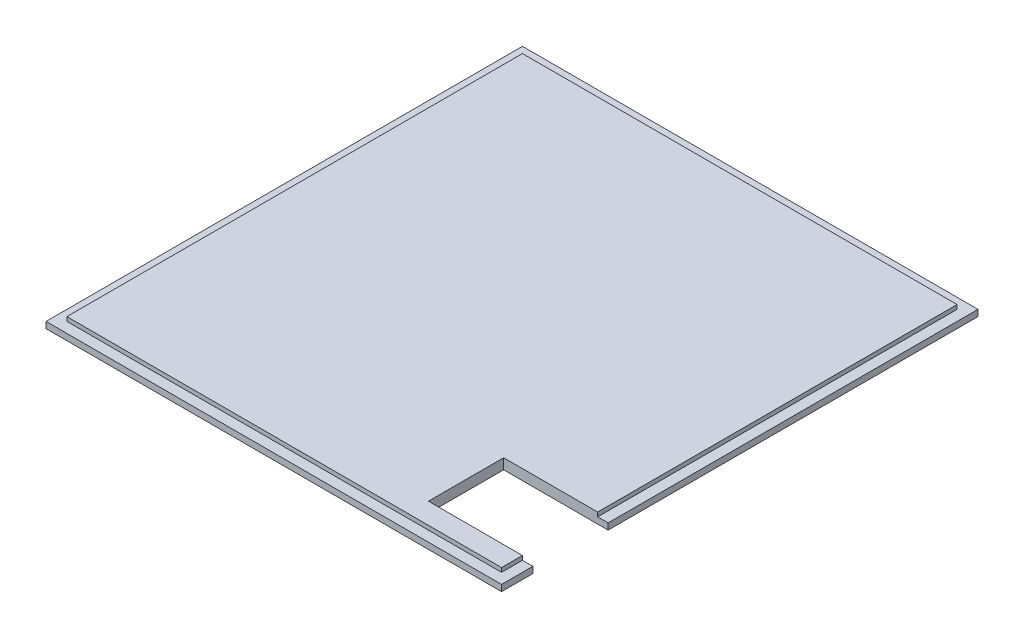
ISO-10303-21;
HEADER;
FILE_DESCRIPTION(('STEP AP214'),'2;1');
FILE_NAME('part.step','',(''),(''),'','','');
FILE_SCHEMA(('AUTOMOTIVE_DESIGN { 1 0 10303 214 1 1 1 1 }'));
ENDSEC;
DATA;
#1=APPLICATION_CONTEXT('core data for automotive mechanical design processes');
#2=APPLICATION_PROTOCOL_DEFINITION('international standard','automotive_design',2000,#1);
#3=PRODUCT_CONTEXT('',#1,'mechanical');
#4=PRODUCT('Part','Part','',(#3));
#5=PRODUCT_RELATED_PRODUCT_CATEGORY('part','',(#4));
#6=PRODUCT_DEFINITION_FORMATION('','',#4);
#7=PRODUCT_DEFINITION_CONTEXT('part definition',#1,'design');
#8=PRODUCT_DEFINITION('design','',#6,#7);
#9=PRODUCT_DEFINITION_SHAPE('','',#8);
#10=(LENGTH_UNIT() NAMED_UNIT(*) SI_UNIT(.MILLI.,.METRE.));
#11=(NAMED_UNIT(*) PLANE_ANGLE_UNIT() SI_UNIT($,.RADIAN.));
#12=(NAMED_UNIT(*) SI_UNIT($,.STERADIAN.) SOLID_ANGLE_UNIT());
#13=UNCERTAINTY_MEASURE_WITH_UNIT(LENGTH_MEASURE(1.E-05),#10,'distance_accuracy_value','');
#14=(GEOMETRIC_REPRESENTATION_CONTEXT(3) GLOBAL_UNCERTAINTY_ASSIGNED_CONTEXT((#13)) GLOBAL_UNIT_ASSIGNED_CONTEXT((#10,
#11,#12)) REPRESENTATION_CONTEXT('',''));
#15=CARTESIAN_POINT('',(0.,0.,0.));
#16=DIRECTION('',(0.,0.,1.));
#17=DIRECTION('',(1.,0.,0.));
#18=AXIS2_PLACEMENT_3D('',#15,#16,#17);
#19=CARTESIAN_POINT('',(54.5,1.5,57.));
#20=DIRECTION('',(-1.,0.,0.));
#21=DIRECTION('',(0.,0.,1.));
#22=AXIS2_PLACEMENT_3D('',#19,#20,#21);
#23=PLANE('',#22);
#24=DIRECTION('',(0.,0.,-1.));
#25=VECTOR('',#24,1.);
#26=CARTESIAN_POINT('',(54.5,0.,57.));
#27=LINE('',#26,#25);
#28=CARTESIAN_POINT('',(54.5,0.,57.));
#29=VERTEX_POINT('',#28);
#30=CARTESIAN_POINT('',(54.5,0.,49.5));
#31=VERTEX_POINT('',#30);
#32=EDGE_CURVE('E261',#29,#31,#27,.T.);
#33=ORIENTED_EDGE('',*,*,#32,.T.);
#34=DIRECTION('',(0.,1.,0.));
#35=VECTOR('',#34,1.);
#36=CARTESIAN_POINT('',(54.5,-30.8058436014987,49.5));
#37=LINE('',#36,#35);
#38=CARTESIAN_POINT('',(54.5,1.5,49.5));
#39=VERTEX_POINT('',#38);
#40=EDGE_CURVE('E169',#31,#39,#37,.T.);
#41=ORIENTED_EDGE('',*,*,#40,.T.);
#42=DIRECTION('',(0.,0.,-1.));
#43=VECTOR('',#42,1.);
#44=CARTESIAN_POINT('',(54.5,1.5,57.));
#45=LINE('',#44,#43);
#46=CARTESIAN_POINT('',(54.5,1.5,57.));
#47=VERTEX_POINT('',#46);
#48=EDGE_CURVE('E246',#47,#39,#45,.T.);
#49=ORIENTED_EDGE('',*,*,#48,.F.);
#50=DIRECTION('',(0.,-1.,0.));
#51=VECTOR('',#50,1.);
#52=CARTESIAN_POINT('',(54.5,1.5,57.));
#53=LINE('',#52,#51);
#54=EDGE_CURVE('E274',#47,#29,#53,.T.);
#55=ORIENTED_EDGE('',*,*,#54,.T.);
#56=EDGE_LOOP('',(#33,#41,#49,#55));
#57=FACE_BOUND('',#56,.T.);
#58=ADVANCED_FACE('F39',(#57),#23,.F.);
#59=CARTESIAN_POINT('',(52.,2.5,54.5));
#60=DIRECTION('',(-1.,0.,0.));
#61=DIRECTION('',(0.,0.,1.));
#62=AXIS2_PLACEMENT_3D('',#59,#60,#61);
#63=PLANE('',#62);
#64=DIRECTION('',(0.,0.,-1.));
#65=VECTOR('',#64,1.);
#66=CARTESIAN_POINT('',(52.,1.5,54.5));
#67=LINE('',#66,#65);
#68=CARTESIAN_POINT('',(52.,1.5,54.5));
#69=VERTEX_POINT('',#68);
#70=CARTESIAN_POINT('',(52.,1.5,49.5));
#71=VERTEX_POINT('',#70);
#72=EDGE_CURVE('E215',#69,#71,#67,.T.);
#73=ORIENTED_EDGE('',*,*,#72,.T.);
#74=DIRECTION('',(0.,1.,0.));
#75=VECTOR('',#74,1.);
#76=CARTESIAN_POINT('',(52.,2.5,49.5));
#77=LINE('',#76,#75);
#78=CARTESIAN_POINT('',(52.,2.5,49.5));
#79=VERTEX_POINT('',#78);
#80=EDGE_CURVE('E185',#71,#79,#77,.T.);
#81=ORIENTED_EDGE('',*,*,#80,.T.);
#82=DIRECTION('',(0.,0.,-1.));
#83=VECTOR('',#82,1.);
#84=CARTESIAN_POINT('',(52.,2.5,54.5));
#85=LINE('',#84,#83);
#86=CARTESIAN_POINT('',(52.,2.5,54.5));
#87=VERTEX_POINT('',#86);
#88=EDGE_CURVE('E201',#87,#79,#85,.T.);
#89=ORIENTED_EDGE('',*,*,#88,.F.);
#90=DIRECTION('',(0.,-1.,0.));
#91=VECTOR('',#90,1.);
#92=CARTESIAN_POINT('',(52.,2.5,54.5));
#93=LINE('',#92,#91);
#94=EDGE_CURVE('E228',#87,#69,#93,.T.);
#95=ORIENTED_EDGE('',*,*,#94,.T.);
#96=EDGE_LOOP('',(#73,#81,#89,#95));
#97=FACE_BOUND('',#96,.T.);
#98=ADVANCED_FACE('F330',(#97),#63,.F.);
#99=CARTESIAN_POINT('',(-54.5,1.5,57.));
#100=DIRECTION('',(1.,0.,0.));
#101=DIRECTION('',(0.,0.,-1.));
#102=AXIS2_PLACEMENT_3D('',#99,#100,#101);
#103=PLANE('',#102);
#104=DIRECTION('',(0.,0.,1.));
#105=VECTOR('',#104,1.);
#106=CARTESIAN_POINT('',(-54.5,0.,57.));
#107=LINE('',#106,#105);
#108=CARTESIAN_POINT('',(-54.5,0.,-57.));
#109=VERTEX_POINT('',#108);
#110=CARTESIAN_POINT('',(-54.5,0.,57.));
#111=VERTEX_POINT('',#110);
#112=EDGE_CURVE('E236',#109,#111,#107,.T.);
#113=ORIENTED_EDGE('',*,*,#112,.T.);
#114=DIRECTION('',(0.,-1.,0.));
#115=VECTOR('',#114,1.);
#116=CARTESIAN_POINT('',(-54.5,1.5,57.));
#117=LINE('',#116,#115);
#118=CARTESIAN_POINT('',(-54.5,1.5,57.));
#119=VERTEX_POINT('',#118);
#120=EDGE_CURVE('E48',#119,#111,#117,.T.);
#121=ORIENTED_EDGE('',*,*,#120,.F.);
#122=DIRECTION('',(0.,0.,1.));
#123=VECTOR('',#122,1.);
#124=CARTESIAN_POINT('',(-54.5,1.5,57.));
#125=LINE('',#124,#123);
#126=CARTESIAN_POINT('',(-54.5,1.5,-57.));
#127=VERTEX_POINT('',#126);
#128=EDGE_CURVE('E237',#127,#119,#125,.T.);
#129=ORIENTED_EDGE('',*,*,#128,.F.);
#130=DIRECTION('',(0.,-1.,0.));
#131=VECTOR('',#130,1.);
#132=CARTESIAN_POINT('',(-54.5,1.5,-57.));
#133=LINE('',#132,#131);
#134=EDGE_CURVE('E253',#127,#109,#133,.T.);
#135=ORIENTED_EDGE('',*,*,#134,.T.);
#136=EDGE_LOOP('',(#113,#121,#129,#135));
#137=FACE_BOUND('',#136,.T.);
#138=ADVANCED_FACE('F41',(#137),#103,.F.);
#139=CARTESIAN_POINT('',(54.5,1.5,57.));
#140=DIRECTION('',(0.,0.,-1.));
#141=DIRECTION('',(-1.,0.,0.));
#142=AXIS2_PLACEMENT_3D('',#139,#140,#141);
#143=PLANE('',#142);
#144=DIRECTION('',(1.,0.,0.));
#145=VECTOR('',#144,1.);
#146=CARTESIAN_POINT('',(54.5,0.,57.));
#147=LINE('',#146,#145);
#148=EDGE_CURVE('E257',#111,#29,#147,.T.);
#149=ORIENTED_EDGE('',*,*,#148,.T.);
#150=ORIENTED_EDGE('',*,*,#54,.F.);
#151=DIRECTION('',(1.,0.,0.));
#152=VECTOR('',#151,1.);
#153=CARTESIAN_POINT('',(54.5,1.5,57.));
#154=LINE('',#153,#152);
#155=EDGE_CURVE('E241',#119,#47,#154,.T.);
#156=ORIENTED_EDGE('',*,*,#155,.F.);
#157=ORIENTED_EDGE('',*,*,#120,.T.);
#158=EDGE_LOOP('',(#149,#150,#156,#157));
#159=FACE_BOUND('',#158,.T.);
#160=ADVANCED_FACE('F281',(#159),#143,.F.);
#161=CARTESIAN_POINT('',(54.5,1.5,31.5));
#162=VERTEX_POINT('',#161);
#163=CARTESIAN_POINT('',(54.5,1.5,-57.));
#164=VERTEX_POINT('',#163);
#165=EDGE_CURVE('E245',#162,#164,#45,.T.);
#166=ORIENTED_EDGE('',*,*,#165,.F.);
#167=DIRECTION('',(0.,1.,0.));
#168=VECTOR('',#167,1.);
#169=CARTESIAN_POINT('',(54.5,-30.8058436014987,31.5));
#170=LINE('',#169,#168);
#171=CARTESIAN_POINT('',(54.5,0.,31.5));
#172=VERTEX_POINT('',#171);
#173=EDGE_CURVE('E156',#172,#162,#170,.T.);
#174=ORIENTED_EDGE('',*,*,#173,.F.);
#175=CARTESIAN_POINT('',(54.5,0.,-57.));
#176=VERTEX_POINT('',#175);
#177=EDGE_CURVE('E260',#172,#176,#27,.T.);
#178=ORIENTED_EDGE('',*,*,#177,.T.);
#179=DIRECTION('',(0.,-1.,0.));
#180=VECTOR('',#179,1.);
#181=CARTESIAN_POINT('',(54.5,1.5,-57.));
#182=LINE('',#181,#180);
#183=EDGE_CURVE('E270',#164,#176,#182,.T.);
#184=ORIENTED_EDGE('',*,*,#183,.F.);
#185=EDGE_LOOP('',(#166,#174,#178,#184));
#186=FACE_BOUND('',#185,.T.);
#187=ADVANCED_FACE('F304',(#186),#23,.F.);
#188=CARTESIAN_POINT('',(54.5,1.5,-57.));
#189=DIRECTION('',(0.,0.,1.));
#190=DIRECTION('',(1.,0.,0.));
#191=AXIS2_PLACEMENT_3D('',#188,#189,#190);
#192=PLANE('',#191);
#193=DIRECTION('',(-1.,0.,0.));
#194=VECTOR('',#193,1.);
#195=CARTESIAN_POINT('',(54.5,0.,-57.));
#196=LINE('',#195,#194);
#197=EDGE_CURVE('E242',#176,#109,#196,.T.);
#198=ORIENTED_EDGE('',*,*,#197,.T.);
#199=ORIENTED_EDGE('',*,*,#134,.F.);
#200=DIRECTION('',(-1.,0.,0.));
#201=VECTOR('',#200,1.);
#202=CARTESIAN_POINT('',(54.5,1.5,-57.));
#203=LINE('',#202,#201);
#204=EDGE_CURVE('E250',#164,#127,#203,.T.);
#205=ORIENTED_EDGE('',*,*,#204,.F.);
#206=ORIENTED_EDGE('',*,*,#183,.T.);
#207=EDGE_LOOP('',(#198,#199,#205,#206));
#208=FACE_BOUND('',#207,.T.);
#209=ADVANCED_FACE('F302',(#208),#192,.F.);
#210=CARTESIAN_POINT('',(0.,1.5,0.));
#211=DIRECTION('',(0.,1.,0.));
#212=DIRECTION('',(0.,0.,1.));
#213=AXIS2_PLACEMENT_3D('',#210,#211,#212);
#214=PLANE('',#213);
#215=DIRECTION('',(1.,0.,0.));
#216=VECTOR('',#215,1.);
#217=CARTESIAN_POINT('',(0.,1.5,49.5));
#218=LINE('',#217,#216);
#219=EDGE_CURVE('E189',#71,#39,#218,.T.);
#220=ORIENTED_EDGE('',*,*,#219,.F.);
#221=ORIENTED_EDGE('',*,*,#72,.F.);
#222=DIRECTION('',(1.,0.,0.));
#223=VECTOR('',#222,1.);
#224=CARTESIAN_POINT('',(52.,1.5,54.5));
#225=LINE('',#224,#223);
#226=CARTESIAN_POINT('',(-52.,1.5,54.5));
#227=VERTEX_POINT('',#226);
#228=EDGE_CURVE('E210',#227,#69,#225,.T.);
#229=ORIENTED_EDGE('',*,*,#228,.F.);
#230=DIRECTION('',(0.,0.,1.));
#231=VECTOR('',#230,1.);
#232=CARTESIAN_POINT('',(-52.,1.5,54.5));
#233=LINE('',#232,#231);
#234=CARTESIAN_POINT('',(-52.,1.5,-54.5));
#235=VERTEX_POINT('',#234);
#236=EDGE_CURVE('E62',#235,#227,#233,.T.);
#237=ORIENTED_EDGE('',*,*,#236,.F.);
#238=DIRECTION('',(-1.,0.,0.));
#239=VECTOR('',#238,1.);
#240=CARTESIAN_POINT('',(52.,1.5,-54.5));
#241=LINE('',#240,#239);
#242=CARTESIAN_POINT('',(52.,1.5,-54.5));
#243=VERTEX_POINT('',#242);
#244=EDGE_CURVE('E197',#243,#235,#241,.T.);
#245=ORIENTED_EDGE('',*,*,#244,.F.);
#246=CARTESIAN_POINT('',(52.,1.5,31.5));
#247=VERTEX_POINT('',#246);
#248=EDGE_CURVE('E214',#247,#243,#67,.T.);
#249=ORIENTED_EDGE('',*,*,#248,.F.);
#250=DIRECTION('',(-1.,0.,0.));
#251=VECTOR('',#250,1.);
#252=CARTESIAN_POINT('',(0.,1.5,31.5));
#253=LINE('',#252,#251);
#254=EDGE_CURVE('E182',#162,#247,#253,.T.);
#255=ORIENTED_EDGE('',*,*,#254,.F.);
#256=ORIENTED_EDGE('',*,*,#165,.T.);
#257=ORIENTED_EDGE('',*,*,#204,.T.);
#258=ORIENTED_EDGE('',*,*,#128,.T.);
#259=ORIENTED_EDGE('',*,*,#155,.T.);
#260=ORIENTED_EDGE('',*,*,#48,.T.);
#261=EDGE_LOOP('',(#220,#221,#229,#237,#245,#249,#255,#256,#257,#258,#259,#260));
#262=FACE_BOUND('',#261,.T.);
#263=ADVANCED_FACE('F296',(#262),#214,.T.);
#264=CARTESIAN_POINT('',(0.,0.,0.));
#265=DIRECTION('',(0.,1.,0.));
#266=DIRECTION('',(0.,0.,1.));
#267=AXIS2_PLACEMENT_3D('',#264,#265,#266);
#268=PLANE('',#267);
#269=DIRECTION('',(0.,0.,-1.));
#270=VECTOR('',#269,1.);
#271=CARTESIAN_POINT('',(29.5,0.,49.5));
#272=LINE('',#271,#270);
#273=CARTESIAN_POINT('',(29.5,0.,49.5));
#274=VERTEX_POINT('',#273);
#275=CARTESIAN_POINT('',(29.5,0.,31.5));
#276=VERTEX_POINT('',#275);
#277=EDGE_CURVE('E153',#274,#276,#272,.T.);
#278=ORIENTED_EDGE('',*,*,#277,.F.);
#279=DIRECTION('',(-1.,0.,0.));
#280=VECTOR('',#279,1.);
#281=CARTESIAN_POINT('',(54.5,0.,49.5));
#282=LINE('',#281,#280);
#283=EDGE_CURVE('E166',#31,#274,#282,.T.);
#284=ORIENTED_EDGE('',*,*,#283,.F.);
#285=ORIENTED_EDGE('',*,*,#32,.F.);
#286=ORIENTED_EDGE('',*,*,#148,.F.);
#287=ORIENTED_EDGE('',*,*,#112,.F.);
#288=ORIENTED_EDGE('',*,*,#197,.F.);
#289=ORIENTED_EDGE('',*,*,#177,.F.);
#290=DIRECTION('',(1.,0.,0.));
#291=VECTOR('',#290,1.);
#292=CARTESIAN_POINT('',(54.5,0.,31.5));
#293=LINE('',#292,#291);
#294=EDGE_CURVE('E177',#276,#172,#293,.T.);
#295=ORIENTED_EDGE('',*,*,#294,.F.);
#296=EDGE_LOOP('',(#278,#284,#285,#286,#287,#288,#289,#295));
#297=FACE_BOUND('',#296,.T.);
#298=ADVANCED_FACE('F289',(#297),#268,.F.);
#299=CARTESIAN_POINT('',(-52.,2.5,54.5));
#300=DIRECTION('',(1.,0.,0.));
#301=DIRECTION('',(0.,0.,-1.));
#302=AXIS2_PLACEMENT_3D('',#299,#300,#301);
#303=PLANE('',#302);
#304=ORIENTED_EDGE('',*,*,#236,.T.);
#305=DIRECTION('',(0.,-1.,0.));
#306=VECTOR('',#305,1.);
#307=CARTESIAN_POINT('',(-52.,2.5,54.5));
#308=LINE('',#307,#306);
#309=CARTESIAN_POINT('',(-52.,2.5,54.5));
#310=VERTEX_POINT('',#309);
#311=EDGE_CURVE('E232',#310,#227,#308,.T.);
#312=ORIENTED_EDGE('',*,*,#311,.F.);
#313=DIRECTION('',(0.,0.,1.));
#314=VECTOR('',#313,1.);
#315=CARTESIAN_POINT('',(-52.,2.5,54.5));
#316=LINE('',#315,#314);
#317=CARTESIAN_POINT('',(-52.,2.5,-54.5));
#318=VERTEX_POINT('',#317);
#319=EDGE_CURVE('E192',#318,#310,#316,.T.);
#320=ORIENTED_EDGE('',*,*,#319,.F.);
#321=DIRECTION('',(0.,-1.,0.));
#322=VECTOR('',#321,1.);
#323=CARTESIAN_POINT('',(-52.,2.5,-54.5));
#324=LINE('',#323,#322);
#325=EDGE_CURVE('E207',#318,#235,#324,.T.);
#326=ORIENTED_EDGE('',*,*,#325,.T.);
#327=EDGE_LOOP('',(#304,#312,#320,#326));
#328=FACE_BOUND('',#327,.T.);
#329=ADVANCED_FACE('F324',(#328),#303,.F.);
#330=CARTESIAN_POINT('',(52.,2.5,54.5));
#331=DIRECTION('',(0.,0.,-1.));
#332=DIRECTION('',(-1.,0.,0.));
#333=AXIS2_PLACEMENT_3D('',#330,#331,#332);
#334=PLANE('',#333);
#335=ORIENTED_EDGE('',*,*,#228,.T.);
#336=ORIENTED_EDGE('',*,*,#94,.F.);
#337=DIRECTION('',(1.,0.,0.));
#338=VECTOR('',#337,1.);
#339=CARTESIAN_POINT('',(52.,2.5,54.5));
#340=LINE('',#339,#338);
#341=EDGE_CURVE('E196',#310,#87,#340,.T.);
#342=ORIENTED_EDGE('',*,*,#341,.F.);
#343=ORIENTED_EDGE('',*,*,#311,.T.);
#344=EDGE_LOOP('',(#335,#336,#342,#343));
#345=FACE_BOUND('',#344,.T.);
#346=ADVANCED_FACE('F326',(#345),#334,.F.);
#347=CARTESIAN_POINT('',(52.,2.5,31.5));
#348=VERTEX_POINT('',#347);
#349=CARTESIAN_POINT('',(52.,2.5,-54.5));
#350=VERTEX_POINT('',#349);
#351=EDGE_CURVE('E200',#348,#350,#85,.T.);
#352=ORIENTED_EDGE('',*,*,#351,.F.);
#353=DIRECTION('',(0.,-1.,0.));
#354=VECTOR('',#353,1.);
#355=CARTESIAN_POINT('',(52.,2.5,31.5));
#356=LINE('',#355,#354);
#357=EDGE_CURVE('E54',#348,#247,#356,.T.);
#358=ORIENTED_EDGE('',*,*,#357,.T.);
#359=ORIENTED_EDGE('',*,*,#248,.T.);
#360=DIRECTION('',(0.,-1.,0.));
#361=VECTOR('',#360,1.);
#362=CARTESIAN_POINT('',(52.,2.5,-54.5));
#363=LINE('',#362,#361);
#364=EDGE_CURVE('E224',#350,#243,#363,.T.);
#365=ORIENTED_EDGE('',*,*,#364,.F.);
#366=EDGE_LOOP('',(#352,#358,#359,#365));
#367=FACE_BOUND('',#366,.T.);
#368=ADVANCED_FACE('F316',(#367),#63,.F.);
#369=CARTESIAN_POINT('',(52.,2.5,-54.5));
#370=DIRECTION('',(0.,0.,1.));
#371=DIRECTION('',(1.,0.,0.));
#372=AXIS2_PLACEMENT_3D('',#369,#370,#371);
#373=PLANE('',#372);
#374=ORIENTED_EDGE('',*,*,#244,.T.);
#375=ORIENTED_EDGE('',*,*,#325,.F.);
#376=DIRECTION('',(-1.,0.,0.));
#377=VECTOR('',#376,1.);
#378=CARTESIAN_POINT('',(52.,2.5,-54.5));
#379=LINE('',#378,#377);
#380=EDGE_CURVE('E204',#350,#318,#379,.T.);
#381=ORIENTED_EDGE('',*,*,#380,.F.);
#382=ORIENTED_EDGE('',*,*,#364,.T.);
#383=EDGE_LOOP('',(#374,#375,#381,#382));
#384=FACE_BOUND('',#383,.T.);
#385=ADVANCED_FACE('F322',(#384),#373,.F.);
#386=CARTESIAN_POINT('',(0.,2.5,0.));
#387=DIRECTION('',(0.,1.,0.));
#388=DIRECTION('',(0.,0.,1.));
#389=AXIS2_PLACEMENT_3D('',#386,#387,#388);
#390=PLANE('',#389);
#391=DIRECTION('',(1.,0.,0.));
#392=VECTOR('',#391,1.);
#393=CARTESIAN_POINT('',(54.5,2.5,49.5));
#394=LINE('',#393,#392);
#395=CARTESIAN_POINT('',(29.5,2.5,49.5));
#396=VERTEX_POINT('',#395);
#397=EDGE_CURVE('E160',#396,#79,#394,.T.);
#398=ORIENTED_EDGE('',*,*,#397,.F.);
#399=DIRECTION('',(0.,0.,1.));
#400=VECTOR('',#399,1.);
#401=CARTESIAN_POINT('',(29.5,2.5,49.5));
#402=LINE('',#401,#400);
#403=CARTESIAN_POINT('',(29.5,2.5,31.5));
#404=VERTEX_POINT('',#403);
#405=EDGE_CURVE('E150',#404,#396,#402,.T.);
#406=ORIENTED_EDGE('',*,*,#405,.F.);
#407=DIRECTION('',(-1.,0.,0.));
#408=VECTOR('',#407,1.);
#409=CARTESIAN_POINT('',(0.,2.5,31.5));
#410=LINE('',#409,#408);
#411=EDGE_CURVE('E11',#348,#404,#410,.T.);
#412=ORIENTED_EDGE('',*,*,#411,.F.);
#413=ORIENTED_EDGE('',*,*,#351,.T.);
#414=ORIENTED_EDGE('',*,*,#380,.T.);
#415=ORIENTED_EDGE('',*,*,#319,.T.);
#416=ORIENTED_EDGE('',*,*,#341,.T.);
#417=ORIENTED_EDGE('',*,*,#88,.T.);
#418=EDGE_LOOP('',(#398,#406,#412,#413,#414,#415,#416,#417));
#419=FACE_BOUND('',#418,.T.);
#420=ADVANCED_FACE('F158',(#419),#390,.T.);
#421=CARTESIAN_POINT('',(54.5,-30.8058436014987,49.5));
#422=DIRECTION('',(0.,0.,1.));
#423=DIRECTION('',(1.,0.,0.));
#424=AXIS2_PLACEMENT_3D('',#421,#422,#423);
#425=PLANE('',#424);
#426=ORIENTED_EDGE('',*,*,#219,.T.);
#427=ORIENTED_EDGE('',*,*,#40,.F.);
#428=ORIENTED_EDGE('',*,*,#283,.T.);
#429=DIRECTION('',(0.,1.,0.));
#430=VECTOR('',#429,1.);
#431=CARTESIAN_POINT('',(29.5,-30.8058436014987,49.5));
#432=LINE('',#431,#430);
#433=EDGE_CURVE('E155',#274,#396,#432,.T.);
#434=ORIENTED_EDGE('',*,*,#433,.T.);
#435=ORIENTED_EDGE('',*,*,#397,.T.);
#436=ORIENTED_EDGE('',*,*,#80,.F.);
#437=EDGE_LOOP('',(#426,#427,#428,#434,#435,#436));
#438=FACE_BOUND('',#437,.T.);
#439=ADVANCED_FACE('F312',(#438),#425,.F.);
#440=CARTESIAN_POINT('',(29.5,-30.8058436014987,49.5));
#441=DIRECTION('',(-1.,0.,0.));
#442=DIRECTION('',(0.,0.,1.));
#443=AXIS2_PLACEMENT_3D('',#440,#441,#442);
#444=PLANE('',#443);
#445=ORIENTED_EDGE('',*,*,#277,.T.);
#446=DIRECTION('',(0.,1.,0.));
#447=VECTOR('',#446,1.);
#448=CARTESIAN_POINT('',(29.5,-30.8058436014987,31.5));
#449=LINE('',#448,#447);
#450=EDGE_CURVE('E141',#276,#404,#449,.T.);
#451=ORIENTED_EDGE('',*,*,#450,.T.);
#452=ORIENTED_EDGE('',*,*,#405,.T.);
#453=ORIENTED_EDGE('',*,*,#433,.F.);
#454=EDGE_LOOP('',(#445,#451,#452,#453));
#455=FACE_BOUND('',#454,.T.);
#456=ADVANCED_FACE('F148',(#455),#444,.F.);
#457=CARTESIAN_POINT('',(54.5,-30.8058436014987,31.5));
#458=DIRECTION('',(0.,0.,-1.));
#459=DIRECTION('',(-1.,0.,0.));
#460=AXIS2_PLACEMENT_3D('',#457,#458,#459);
#461=PLANE('',#460);
#462=ORIENTED_EDGE('',*,*,#254,.T.);
#463=ORIENTED_EDGE('',*,*,#357,.F.);
#464=ORIENTED_EDGE('',*,*,#411,.T.);
#465=ORIENTED_EDGE('',*,*,#450,.F.);
#466=ORIENTED_EDGE('',*,*,#294,.T.);
#467=ORIENTED_EDGE('',*,*,#173,.T.);
#468=EDGE_LOOP('',(#462,#463,#464,#465,#466,#467));
#469=FACE_BOUND('',#468,.T.);
#470=ADVANCED_FACE('F140',(#469),#461,.F.);
#471=CLOSED_SHELL('',(#58,#98,#138,#160,#187,#209,#263,#298,#329,#346,#368,#385,#420,#439,#456,#470));
#472=MANIFOLD_SOLID_BREP('B2',#471);
#473=ADVANCED_BREP_SHAPE_REPRESENTATION('',(#18,#472),#14);
#474=SHAPE_DEFINITION_REPRESENTATION(#9,#473);
ENDSEC;
END-ISO-10303-21;
